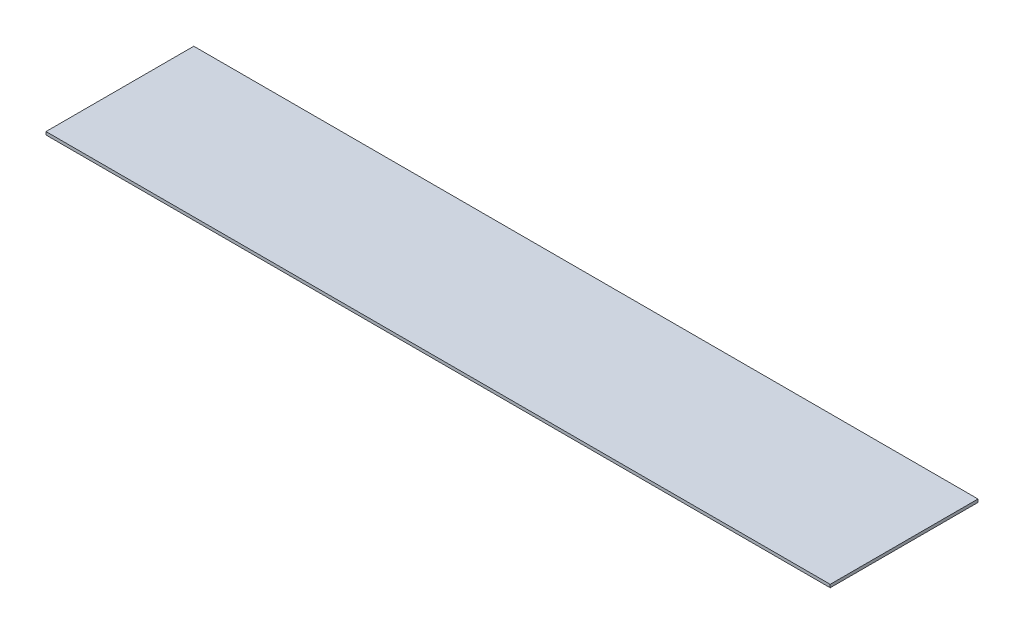
ISO-10303-21;
HEADER;
FILE_DESCRIPTION(('STEP AP214'),'2;1');
FILE_NAME('part.step','',(''),(''),'','','');
FILE_SCHEMA(('AUTOMOTIVE_DESIGN { 1 0 10303 214 1 1 1 1 }'));
ENDSEC;
DATA;
#1=APPLICATION_CONTEXT('core data for automotive mechanical design processes');
#2=APPLICATION_PROTOCOL_DEFINITION('international standard','automotive_design',2000,#1);
#3=PRODUCT_CONTEXT('',#1,'mechanical');
#4=PRODUCT('Part','Part','',(#3));
#5=PRODUCT_RELATED_PRODUCT_CATEGORY('part','',(#4));
#6=PRODUCT_DEFINITION_FORMATION('','',#4);
#7=PRODUCT_DEFINITION_CONTEXT('part definition',#1,'design');
#8=PRODUCT_DEFINITION('design','',#6,#7);
#9=PRODUCT_DEFINITION_SHAPE('','',#8);
#10=(LENGTH_UNIT() NAMED_UNIT(*) SI_UNIT(.MILLI.,.METRE.));
#11=(NAMED_UNIT(*) PLANE_ANGLE_UNIT() SI_UNIT($,.RADIAN.));
#12=(NAMED_UNIT(*) SI_UNIT($,.STERADIAN.) SOLID_ANGLE_UNIT());
#13=UNCERTAINTY_MEASURE_WITH_UNIT(LENGTH_MEASURE(1.E-05),#10,'distance_accuracy_value','');
#14=(GEOMETRIC_REPRESENTATION_CONTEXT(3) GLOBAL_UNCERTAINTY_ASSIGNED_CONTEXT((#13)) GLOBAL_UNIT_ASSIGNED_CONTEXT((#10,
#11,#12)) REPRESENTATION_CONTEXT('',''));
#15=CARTESIAN_POINT('',(0.,0.,0.));
#16=DIRECTION('',(0.,0.,1.));
#17=DIRECTION('',(1.,0.,0.));
#18=AXIS2_PLACEMENT_3D('',#15,#16,#17);
#19=CARTESIAN_POINT('',(-106.315789473684,1.,-50.7894736842105));
#20=DIRECTION('',(1.,0.,0.));
#21=DIRECTION('',(0.,0.,-1.));
#22=AXIS2_PLACEMENT_3D('',#19,#20,#21);
#23=PLANE('',#22);
#24=DIRECTION('',(0.,0.,1.));
#25=VECTOR('',#24,1.);
#26=CARTESIAN_POINT('',(-106.315789473684,0.,-50.7894736842105));
#27=LINE('',#26,#25);
#28=CARTESIAN_POINT('',(-106.315789473684,0.,-50.7894736842105));
#29=VERTEX_POINT('',#28);
#30=CARTESIAN_POINT('',(-106.315789473684,0.,-1.78947368421051));
#31=VERTEX_POINT('',#30);
#32=EDGE_CURVE('E97',#29,#31,#27,.T.);
#33=ORIENTED_EDGE('',*,*,#32,.T.);
#34=DIRECTION('',(0.,-1.,0.));
#35=VECTOR('',#34,1.);
#36=CARTESIAN_POINT('',(-106.315789473684,1.,-1.78947368421051));
#37=LINE('',#36,#35);
#38=CARTESIAN_POINT('',(-106.315789473684,1.,-1.78947368421051));
#39=VERTEX_POINT('',#38);
#40=EDGE_CURVE('E11',#39,#31,#37,.T.);
#41=ORIENTED_EDGE('',*,*,#40,.F.);
#42=DIRECTION('',(0.,0.,1.));
#43=VECTOR('',#42,1.);
#44=CARTESIAN_POINT('',(-106.315789473684,1.,-50.7894736842105));
#45=LINE('',#44,#43);
#46=CARTESIAN_POINT('',(-106.315789473684,1.,-50.7894736842105));
#47=VERTEX_POINT('',#46);
#48=EDGE_CURVE('E85',#47,#39,#45,.T.);
#49=ORIENTED_EDGE('',*,*,#48,.F.);
#50=DIRECTION('',(0.,-1.,0.));
#51=VECTOR('',#50,1.);
#52=CARTESIAN_POINT('',(-106.315789473684,1.,-50.7894736842105));
#53=LINE('',#52,#51);
#54=EDGE_CURVE('E93',#47,#29,#53,.T.);
#55=ORIENTED_EDGE('',*,*,#54,.T.);
#56=EDGE_LOOP('',(#33,#41,#49,#55));
#57=FACE_BOUND('',#56,.T.);
#58=ADVANCED_FACE('F34',(#57),#23,.F.);
#59=CARTESIAN_POINT('',(-106.315789473684,1.,-1.78947368421051));
#60=DIRECTION('',(0.,0.,-1.));
#61=DIRECTION('',(-1.,0.,0.));
#62=AXIS2_PLACEMENT_3D('',#59,#60,#61);
#63=PLANE('',#62);
#64=DIRECTION('',(1.,0.,0.));
#65=VECTOR('',#64,1.);
#66=CARTESIAN_POINT('',(-106.315789473684,0.,-1.78947368421051));
#67=LINE('',#66,#65);
#68=CARTESIAN_POINT('',(153.684210526316,0.,-1.78947368421051));
#69=VERTEX_POINT('',#68);
#70=EDGE_CURVE('E89',#31,#69,#67,.T.);
#71=ORIENTED_EDGE('',*,*,#70,.T.);
#72=DIRECTION('',(0.,-1.,0.));
#73=VECTOR('',#72,1.);
#74=CARTESIAN_POINT('',(153.684210526316,1.,-1.78947368421051));
#75=LINE('',#74,#73);
#76=CARTESIAN_POINT('',(153.684210526316,1.,-1.78947368421051));
#77=VERTEX_POINT('',#76);
#78=EDGE_CURVE('E42',#77,#69,#75,.T.);
#79=ORIENTED_EDGE('',*,*,#78,.F.);
#80=DIRECTION('',(1.,0.,0.));
#81=VECTOR('',#80,1.);
#82=CARTESIAN_POINT('',(-106.315789473684,1.,-1.78947368421051));
#83=LINE('',#82,#81);
#84=EDGE_CURVE('E80',#39,#77,#83,.T.);
#85=ORIENTED_EDGE('',*,*,#84,.F.);
#86=ORIENTED_EDGE('',*,*,#40,.T.);
#87=EDGE_LOOP('',(#71,#79,#85,#86));
#88=FACE_BOUND('',#87,.T.);
#89=ADVANCED_FACE('F88',(#88),#63,.F.);
#90=CARTESIAN_POINT('',(153.684210526316,1.,-50.7894736842105));
#91=DIRECTION('',(-1.,0.,0.));
#92=DIRECTION('',(0.,0.,1.));
#93=AXIS2_PLACEMENT_3D('',#90,#91,#92);
#94=PLANE('',#93);
#95=DIRECTION('',(0.,0.,-1.));
#96=VECTOR('',#95,1.);
#97=CARTESIAN_POINT('',(153.684210526316,0.,-50.7894736842105));
#98=LINE('',#97,#96);
#99=CARTESIAN_POINT('',(153.684210526316,0.,-50.7894736842105));
#100=VERTEX_POINT('',#99);
#101=EDGE_CURVE('E67',#69,#100,#98,.T.);
#102=ORIENTED_EDGE('',*,*,#101,.T.);
#103=DIRECTION('',(0.,-1.,0.));
#104=VECTOR('',#103,1.);
#105=CARTESIAN_POINT('',(153.684210526316,1.,-50.7894736842105));
#106=LINE('',#105,#104);
#107=CARTESIAN_POINT('',(153.684210526316,1.,-50.7894736842105));
#108=VERTEX_POINT('',#107);
#109=EDGE_CURVE('E90',#108,#100,#106,.T.);
#110=ORIENTED_EDGE('',*,*,#109,.F.);
#111=DIRECTION('',(0.,0.,-1.));
#112=VECTOR('',#111,1.);
#113=CARTESIAN_POINT('',(153.684210526316,1.,-50.7894736842105));
#114=LINE('',#113,#112);
#115=EDGE_CURVE('E83',#77,#108,#114,.T.);
#116=ORIENTED_EDGE('',*,*,#115,.F.);
#117=ORIENTED_EDGE('',*,*,#78,.T.);
#118=EDGE_LOOP('',(#102,#110,#116,#117));
#119=FACE_BOUND('',#118,.T.);
#120=ADVANCED_FACE('F91',(#119),#94,.F.);
#121=CARTESIAN_POINT('',(-106.315789473684,1.,-50.7894736842105));
#122=DIRECTION('',(0.,0.,1.));
#123=DIRECTION('',(1.,0.,0.));
#124=AXIS2_PLACEMENT_3D('',#121,#122,#123);
#125=PLANE('',#124);
#126=DIRECTION('',(-1.,0.,0.));
#127=VECTOR('',#126,1.);
#128=CARTESIAN_POINT('',(-106.315789473684,0.,-50.7894736842105));
#129=LINE('',#128,#127);
#130=EDGE_CURVE('E73',#100,#29,#129,.T.);
#131=ORIENTED_EDGE('',*,*,#130,.T.);
#132=ORIENTED_EDGE('',*,*,#54,.F.);
#133=DIRECTION('',(-1.,0.,0.));
#134=VECTOR('',#133,1.);
#135=CARTESIAN_POINT('',(-106.315789473684,1.,-50.7894736842105));
#136=LINE('',#135,#134);
#137=EDGE_CURVE('E50',#108,#47,#136,.T.);
#138=ORIENTED_EDGE('',*,*,#137,.F.);
#139=ORIENTED_EDGE('',*,*,#109,.T.);
#140=EDGE_LOOP('',(#131,#132,#138,#139));
#141=FACE_BOUND('',#140,.T.);
#142=ADVANCED_FACE('F104',(#141),#125,.F.);
#143=CARTESIAN_POINT('',(0.,1.,0.));
#144=DIRECTION('',(0.,1.,0.));
#145=DIRECTION('',(0.,0.,1.));
#146=AXIS2_PLACEMENT_3D('',#143,#144,#145);
#147=PLANE('',#146);
#148=ORIENTED_EDGE('',*,*,#48,.T.);
#149=ORIENTED_EDGE('',*,*,#84,.T.);
#150=ORIENTED_EDGE('',*,*,#115,.T.);
#151=ORIENTED_EDGE('',*,*,#137,.T.);
#152=EDGE_LOOP('',(#148,#149,#150,#151));
#153=FACE_BOUND('',#152,.T.);
#154=ADVANCED_FACE('F81',(#153),#147,.T.);
#155=CARTESIAN_POINT('',(0.,0.,0.));
#156=DIRECTION('',(0.,1.,0.));
#157=DIRECTION('',(0.,0.,1.));
#158=AXIS2_PLACEMENT_3D('',#155,#156,#157);
#159=PLANE('',#158);
#160=ORIENTED_EDGE('',*,*,#32,.F.);
#161=ORIENTED_EDGE('',*,*,#130,.F.);
#162=ORIENTED_EDGE('',*,*,#101,.F.);
#163=ORIENTED_EDGE('',*,*,#70,.F.);
#164=EDGE_LOOP('',(#160,#161,#162,#163));
#165=FACE_BOUND('',#164,.T.);
#166=ADVANCED_FACE('F107',(#165),#159,.F.);
#167=CLOSED_SHELL('',(#58,#89,#120,#142,#154,#166));
#168=MANIFOLD_SOLID_BREP('B2',#167);
#169=ADVANCED_BREP_SHAPE_REPRESENTATION('',(#18,#168),#14);
#170=SHAPE_DEFINITION_REPRESENTATION(#9,#169);
ENDSEC;
END-ISO-10303-21;
